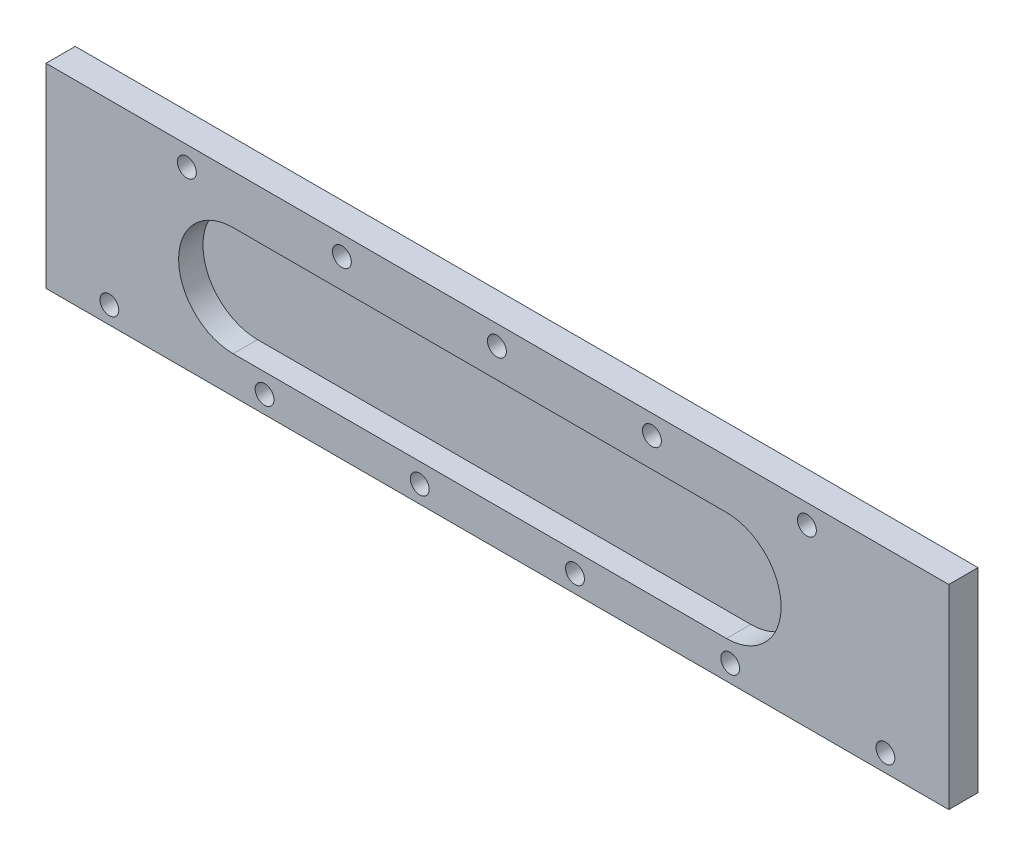
ISO-10303-21;
HEADER;
FILE_DESCRIPTION(('STEP AP214'),'2;1');
FILE_NAME('part.step','',(''),(''),'','','');
FILE_SCHEMA(('AUTOMOTIVE_DESIGN { 1 0 10303 214 1 1 1 1 }'));
ENDSEC;
DATA;
#1=APPLICATION_CONTEXT('core data for automotive mechanical design processes');
#2=APPLICATION_PROTOCOL_DEFINITION('international standard','automotive_design',2000,#1);
#3=PRODUCT_CONTEXT('',#1,'mechanical');
#4=PRODUCT('Part','Part','',(#3));
#5=PRODUCT_RELATED_PRODUCT_CATEGORY('part','',(#4));
#6=PRODUCT_DEFINITION_FORMATION('','',#4);
#7=PRODUCT_DEFINITION_CONTEXT('part definition',#1,'design');
#8=PRODUCT_DEFINITION('design','',#6,#7);
#9=PRODUCT_DEFINITION_SHAPE('','',#8);
#10=(LENGTH_UNIT() NAMED_UNIT(*) SI_UNIT(.MILLI.,.METRE.));
#11=(NAMED_UNIT(*) PLANE_ANGLE_UNIT() SI_UNIT($,.RADIAN.));
#12=(NAMED_UNIT(*) SI_UNIT($,.STERADIAN.) SOLID_ANGLE_UNIT());
#13=UNCERTAINTY_MEASURE_WITH_UNIT(LENGTH_MEASURE(1.E-05),#10,'distance_accuracy_value','');
#14=(GEOMETRIC_REPRESENTATION_CONTEXT(3) GLOBAL_UNCERTAINTY_ASSIGNED_CONTEXT((#13)) GLOBAL_UNIT_ASSIGNED_CONTEXT((#10,
#11,#12)) REPRESENTATION_CONTEXT('',''));
#15=CARTESIAN_POINT('',(0.,0.,0.));
#16=DIRECTION('',(0.,0.,1.));
#17=DIRECTION('',(1.,0.,0.));
#18=AXIS2_PLACEMENT_3D('',#15,#16,#17);
#19=CARTESIAN_POINT('',(0.,0.,7.62));
#20=DIRECTION('',(-1.,0.,0.));
#21=DIRECTION('',(0.,0.,1.));
#22=AXIS2_PLACEMENT_3D('',#19,#20,#21);
#23=PLANE('',#22);
#24=DIRECTION('',(0.,1.,0.));
#25=VECTOR('',#24,1.);
#26=CARTESIAN_POINT('',(0.,0.,0.));
#27=LINE('',#26,#25);
#28=CARTESIAN_POINT('',(0.,0.,0.));
#29=VERTEX_POINT('',#28);
#30=CARTESIAN_POINT('',(0.,50.8,0.));
#31=VERTEX_POINT('',#30);
#32=EDGE_CURVE('E156',#29,#31,#27,.T.);
#33=ORIENTED_EDGE('',*,*,#32,.T.);
#34=DIRECTION('',(0.,0.,-1.));
#35=VECTOR('',#34,1.);
#36=CARTESIAN_POINT('',(0.,50.8,7.62));
#37=LINE('',#36,#35);
#38=CARTESIAN_POINT('',(0.,50.8,7.62));
#39=VERTEX_POINT('',#38);
#40=EDGE_CURVE('E13',#39,#31,#37,.T.);
#41=ORIENTED_EDGE('',*,*,#40,.F.);
#42=DIRECTION('',(0.,1.,0.));
#43=VECTOR('',#42,1.);
#44=CARTESIAN_POINT('',(0.,0.,7.62));
#45=LINE('',#44,#43);
#46=CARTESIAN_POINT('',(0.,0.,7.62));
#47=VERTEX_POINT('',#46);
#48=EDGE_CURVE('E160',#47,#39,#45,.T.);
#49=ORIENTED_EDGE('',*,*,#48,.F.);
#50=DIRECTION('',(0.,0.,-1.));
#51=VECTOR('',#50,1.);
#52=CARTESIAN_POINT('',(0.,0.,7.62));
#53=LINE('',#52,#51);
#54=EDGE_CURVE('E166',#47,#29,#53,.T.);
#55=ORIENTED_EDGE('',*,*,#54,.T.);
#56=EDGE_LOOP('',(#33,#41,#49,#55));
#57=FACE_BOUND('',#56,.T.);
#58=ADVANCED_FACE('F45',(#57),#23,.F.);
#59=CARTESIAN_POINT('',(0.,50.8,7.62));
#60=DIRECTION('',(0.,-1.,0.));
#61=DIRECTION('',(1.,0.,0.));
#62=AXIS2_PLACEMENT_3D('',#59,#60,#61);
#63=PLANE('',#62);
#64=DIRECTION('',(-1.,0.,0.));
#65=VECTOR('',#64,1.);
#66=CARTESIAN_POINT('',(0.,50.8,0.));
#67=LINE('',#66,#65);
#68=CARTESIAN_POINT('',(-235.204,50.8,0.));
#69=VERTEX_POINT('',#68);
#70=EDGE_CURVE('E169',#31,#69,#67,.T.);
#71=ORIENTED_EDGE('',*,*,#70,.T.);
#72=DIRECTION('',(0.,0.,-1.));
#73=VECTOR('',#72,1.);
#74=CARTESIAN_POINT('',(-235.204,50.8,7.62));
#75=LINE('',#74,#73);
#76=CARTESIAN_POINT('',(-235.204,50.8,7.62));
#77=VERTEX_POINT('',#76);
#78=EDGE_CURVE('E52',#77,#69,#75,.T.);
#79=ORIENTED_EDGE('',*,*,#78,.F.);
#80=DIRECTION('',(-1.,0.,0.));
#81=VECTOR('',#80,1.);
#82=CARTESIAN_POINT('',(0.,50.8,7.62));
#83=LINE('',#82,#81);
#84=EDGE_CURVE('E96',#39,#77,#83,.T.);
#85=ORIENTED_EDGE('',*,*,#84,.F.);
#86=ORIENTED_EDGE('',*,*,#40,.T.);
#87=EDGE_LOOP('',(#71,#79,#85,#86));
#88=FACE_BOUND('',#87,.T.);
#89=ADVANCED_FACE('F198',(#88),#63,.F.);
#90=CARTESIAN_POINT('',(-235.204,0.,7.62));
#91=DIRECTION('',(1.,0.,0.));
#92=DIRECTION('',(0.,0.,-1.));
#93=AXIS2_PLACEMENT_3D('',#90,#91,#92);
#94=PLANE('',#93);
#95=DIRECTION('',(0.,-1.,0.));
#96=VECTOR('',#95,1.);
#97=CARTESIAN_POINT('',(-235.204,0.,0.));
#98=LINE('',#97,#96);
#99=CARTESIAN_POINT('',(-235.204,0.,0.));
#100=VERTEX_POINT('',#99);
#101=EDGE_CURVE('E171',#69,#100,#98,.T.);
#102=ORIENTED_EDGE('',*,*,#101,.T.);
#103=DIRECTION('',(0.,0.,-1.));
#104=VECTOR('',#103,1.);
#105=CARTESIAN_POINT('',(-235.204,0.,7.62));
#106=LINE('',#105,#104);
#107=CARTESIAN_POINT('',(-235.204,0.,7.62));
#108=VERTEX_POINT('',#107);
#109=EDGE_CURVE('E175',#108,#100,#106,.T.);
#110=ORIENTED_EDGE('',*,*,#109,.F.);
#111=DIRECTION('',(0.,-1.,0.));
#112=VECTOR('',#111,1.);
#113=CARTESIAN_POINT('',(-235.204,0.,7.62));
#114=LINE('',#113,#112);
#115=EDGE_CURVE('E163',#77,#108,#114,.T.);
#116=ORIENTED_EDGE('',*,*,#115,.F.);
#117=ORIENTED_EDGE('',*,*,#78,.T.);
#118=EDGE_LOOP('',(#102,#110,#116,#117));
#119=FACE_BOUND('',#118,.T.);
#120=ADVANCED_FACE('F180',(#119),#94,.F.);
#121=CARTESIAN_POINT('',(0.,0.,7.62));
#122=DIRECTION('',(0.,1.,0.));
#123=DIRECTION('',(-1.,0.,0.));
#124=AXIS2_PLACEMENT_3D('',#121,#122,#123);
#125=PLANE('',#124);
#126=DIRECTION('',(1.,0.,0.));
#127=VECTOR('',#126,1.);
#128=CARTESIAN_POINT('',(0.,0.,0.));
#129=LINE('',#128,#127);
#130=EDGE_CURVE('E89',#100,#29,#129,.T.);
#131=ORIENTED_EDGE('',*,*,#130,.T.);
#132=ORIENTED_EDGE('',*,*,#54,.F.);
#133=DIRECTION('',(1.,0.,0.));
#134=VECTOR('',#133,1.);
#135=CARTESIAN_POINT('',(0.,0.,7.62));
#136=LINE('',#135,#134);
#137=EDGE_CURVE('E68',#108,#47,#136,.T.);
#138=ORIENTED_EDGE('',*,*,#137,.F.);
#139=ORIENTED_EDGE('',*,*,#109,.T.);
#140=EDGE_LOOP('',(#131,#132,#138,#139));
#141=FACE_BOUND('',#140,.T.);
#142=ADVANCED_FACE('F188',(#141),#125,.F.);
#143=CARTESIAN_POINT('',(0.,0.,7.62));
#144=DIRECTION('',(0.,0.,1.));
#145=DIRECTION('',(1.,0.,0.));
#146=AXIS2_PLACEMENT_3D('',#143,#144,#145);
#147=PLANE('',#146);
#148=CARTESIAN_POINT('',(-198.501,45.72,7.62));
#149=DIRECTION('',(0.,0.,1.));
#150=DIRECTION('',(1.,0.,0.));
#151=AXIS2_PLACEMENT_3D('',#148,#149,#150);
#152=CIRCLE('',#151,2.45745);
#153=CARTESIAN_POINT('',(-196.04355,45.72,7.62));
#154=VERTEX_POINT('',#153);
#155=EDGE_CURVE('E393',#154,#154,#152,.T.);
#156=ORIENTED_EDGE('',*,*,#155,.F.);
#157=EDGE_LOOP('',(#156));
#158=FACE_BOUND('',#157,.T.);
#159=CARTESIAN_POINT('',(-158.115,45.72,7.62));
#160=DIRECTION('',(0.,0.,1.));
#161=DIRECTION('',(1.,0.,0.));
#162=AXIS2_PLACEMENT_3D('',#159,#160,#161);
#163=CIRCLE('',#162,2.45745);
#164=CARTESIAN_POINT('',(-155.65755,45.72,7.62));
#165=VERTEX_POINT('',#164);
#166=EDGE_CURVE('E395',#165,#165,#163,.T.);
#167=ORIENTED_EDGE('',*,*,#166,.F.);
#168=EDGE_LOOP('',(#167));
#169=FACE_BOUND('',#168,.T.);
#170=CARTESIAN_POINT('',(-117.729,45.72,7.62));
#171=DIRECTION('',(0.,0.,1.));
#172=DIRECTION('',(1.,0.,0.));
#173=AXIS2_PLACEMENT_3D('',#170,#171,#172);
#174=CIRCLE('',#173,2.45745);
#175=CARTESIAN_POINT('',(-115.27155,45.72,7.62));
#176=VERTEX_POINT('',#175);
#177=EDGE_CURVE('E403',#176,#176,#174,.T.);
#178=ORIENTED_EDGE('',*,*,#177,.F.);
#179=EDGE_LOOP('',(#178));
#180=FACE_BOUND('',#179,.T.);
#181=CARTESIAN_POINT('',(-77.343,45.72,7.62));
#182=DIRECTION('',(0.,0.,1.));
#183=DIRECTION('',(1.,0.,0.));
#184=AXIS2_PLACEMENT_3D('',#181,#182,#183);
#185=CIRCLE('',#184,2.45745);
#186=CARTESIAN_POINT('',(-74.88555,45.72,7.62));
#187=VERTEX_POINT('',#186);
#188=EDGE_CURVE('E409',#187,#187,#185,.T.);
#189=ORIENTED_EDGE('',*,*,#188,.F.);
#190=EDGE_LOOP('',(#189));
#191=FACE_BOUND('',#190,.T.);
#192=CARTESIAN_POINT('',(-36.957,45.72,7.62));
#193=DIRECTION('',(0.,0.,1.));
#194=DIRECTION('',(1.,0.,0.));
#195=AXIS2_PLACEMENT_3D('',#192,#193,#194);
#196=CIRCLE('',#195,2.45745);
#197=CARTESIAN_POINT('',(-34.49955,45.72,7.62));
#198=VERTEX_POINT('',#197);
#199=EDGE_CURVE('E415',#198,#198,#196,.T.);
#200=ORIENTED_EDGE('',*,*,#199,.F.);
#201=EDGE_LOOP('',(#200));
#202=FACE_BOUND('',#201,.T.);
#203=CARTESIAN_POINT('',(-218.694,4.54847930763691,7.62));
#204=DIRECTION('',(0.,0.,1.));
#205=DIRECTION('',(1.,0.,0.));
#206=AXIS2_PLACEMENT_3D('',#203,#204,#205);
#207=CIRCLE('',#206,2.45745);
#208=CARTESIAN_POINT('',(-216.23655,4.54847930763691,7.62));
#209=VERTEX_POINT('',#208);
#210=EDGE_CURVE('E421',#209,#209,#207,.T.);
#211=ORIENTED_EDGE('',*,*,#210,.F.);
#212=EDGE_LOOP('',(#211));
#213=FACE_BOUND('',#212,.T.);
#214=CARTESIAN_POINT('',(-178.2572,4.54847930763691,7.62));
#215=DIRECTION('',(0.,0.,1.));
#216=DIRECTION('',(1.,0.,0.));
#217=AXIS2_PLACEMENT_3D('',#214,#215,#216);
#218=CIRCLE('',#217,2.45745);
#219=CARTESIAN_POINT('',(-175.79975,4.54847930763691,7.62));
#220=VERTEX_POINT('',#219);
#221=EDGE_CURVE('E427',#220,#220,#218,.T.);
#222=ORIENTED_EDGE('',*,*,#221,.F.);
#223=EDGE_LOOP('',(#222));
#224=FACE_BOUND('',#223,.T.);
#225=CARTESIAN_POINT('',(-137.8204,4.54847930763691,7.62));
#226=DIRECTION('',(0.,0.,1.));
#227=DIRECTION('',(1.,0.,0.));
#228=AXIS2_PLACEMENT_3D('',#225,#226,#227);
#229=CIRCLE('',#228,2.45745);
#230=CARTESIAN_POINT('',(-135.36295,4.54847930763691,7.62));
#231=VERTEX_POINT('',#230);
#232=EDGE_CURVE('E433',#231,#231,#229,.T.);
#233=ORIENTED_EDGE('',*,*,#232,.F.);
#234=EDGE_LOOP('',(#233));
#235=FACE_BOUND('',#234,.T.);
#236=CARTESIAN_POINT('',(-97.3836,4.54847930763691,7.62));
#237=DIRECTION('',(0.,0.,1.));
#238=DIRECTION('',(1.,0.,0.));
#239=AXIS2_PLACEMENT_3D('',#236,#237,#238);
#240=CIRCLE('',#239,2.45745);
#241=CARTESIAN_POINT('',(-94.92615,4.54847930763691,7.62));
#242=VERTEX_POINT('',#241);
#243=EDGE_CURVE('E439',#242,#242,#240,.T.);
#244=ORIENTED_EDGE('',*,*,#243,.F.);
#245=EDGE_LOOP('',(#244));
#246=FACE_BOUND('',#245,.T.);
#247=CARTESIAN_POINT('',(-56.9468,4.54847930763691,7.62));
#248=DIRECTION('',(0.,0.,1.));
#249=DIRECTION('',(1.,0.,0.));
#250=AXIS2_PLACEMENT_3D('',#247,#248,#249);
#251=CIRCLE('',#250,2.45745);
#252=CARTESIAN_POINT('',(-54.48935,4.54847930763691,7.62));
#253=VERTEX_POINT('',#252);
#254=EDGE_CURVE('E445',#253,#253,#251,.T.);
#255=ORIENTED_EDGE('',*,*,#254,.F.);
#256=EDGE_LOOP('',(#255));
#257=FACE_BOUND('',#256,.T.);
#258=CARTESIAN_POINT('',(-16.51,4.54847930763691,7.62));
#259=DIRECTION('',(0.,0.,1.));
#260=DIRECTION('',(1.,0.,0.));
#261=AXIS2_PLACEMENT_3D('',#258,#259,#260);
#262=CIRCLE('',#261,2.45745);
#263=CARTESIAN_POINT('',(-14.05255,4.54847930763691,7.62));
#264=VERTEX_POINT('',#263);
#265=EDGE_CURVE('E450',#264,#264,#262,.T.);
#266=ORIENTED_EDGE('',*,*,#265,.F.);
#267=EDGE_LOOP('',(#266));
#268=FACE_BOUND('',#267,.T.);
#269=CARTESIAN_POINT('',(-57.912,23.876,7.62));
#270=DIRECTION('',(0.,0.,1.));
#271=DIRECTION('',(1.,0.,0.));
#272=AXIS2_PLACEMENT_3D('',#269,#270,#271);
#273=CIRCLE('',#272,14.224);
#274=CARTESIAN_POINT('',(-57.912,9.652,7.62));
#275=VERTEX_POINT('',#274);
#276=CARTESIAN_POINT('',(-57.912,38.1,7.62));
#277=VERTEX_POINT('',#276);
#278=EDGE_CURVE('E59',#275,#277,#273,.T.);
#279=ORIENTED_EDGE('',*,*,#278,.F.);
#280=DIRECTION('',(1.,0.,0.));
#281=VECTOR('',#280,1.);
#282=CARTESIAN_POINT('',(-57.912,9.652,7.62));
#283=LINE('',#282,#281);
#284=CARTESIAN_POINT('',(-186.436,9.652,7.62));
#285=VERTEX_POINT('',#284);
#286=EDGE_CURVE('E138',#285,#275,#283,.T.);
#287=ORIENTED_EDGE('',*,*,#286,.F.);
#288=CARTESIAN_POINT('',(-186.436,23.876,7.62));
#289=DIRECTION('',(0.,0.,1.));
#290=DIRECTION('',(1.,0.,0.));
#291=AXIS2_PLACEMENT_3D('',#288,#289,#290);
#292=CIRCLE('',#291,14.224);
#293=CARTESIAN_POINT('',(-186.436,38.1,7.62));
#294=VERTEX_POINT('',#293);
#295=EDGE_CURVE('E141',#294,#285,#292,.T.);
#296=ORIENTED_EDGE('',*,*,#295,.F.);
#297=DIRECTION('',(-1.,0.,0.));
#298=VECTOR('',#297,1.);
#299=CARTESIAN_POINT('',(-57.912,38.1,7.62));
#300=LINE('',#299,#298);
#301=EDGE_CURVE('E150',#277,#294,#300,.T.);
#302=ORIENTED_EDGE('',*,*,#301,.F.);
#303=EDGE_LOOP('',(#279,#287,#296,#302));
#304=FACE_BOUND('',#303,.T.);
#305=ORIENTED_EDGE('',*,*,#48,.T.);
#306=ORIENTED_EDGE('',*,*,#84,.T.);
#307=ORIENTED_EDGE('',*,*,#115,.T.);
#308=ORIENTED_EDGE('',*,*,#137,.T.);
#309=EDGE_LOOP('',(#305,#306,#307,#308));
#310=FACE_BOUND('',#309,.T.);
#311=ADVANCED_FACE('F190',(#158,#169,#180,#191,#202,#213,#224,#235,#246,#257,#268,#304,#310),
#147,.T.);
#312=CARTESIAN_POINT('',(0.,0.,0.));
#313=DIRECTION('',(0.,0.,1.));
#314=DIRECTION('',(1.,0.,0.));
#315=AXIS2_PLACEMENT_3D('',#312,#313,#314);
#316=PLANE('',#315);
#317=CARTESIAN_POINT('',(-198.501,45.72,0.));
#318=DIRECTION('',(0.,0.,1.));
#319=DIRECTION('',(1.,0.,0.));
#320=AXIS2_PLACEMENT_3D('',#317,#318,#319);
#321=CIRCLE('',#320,2.45745);
#322=CARTESIAN_POINT('',(-196.04355,45.72,0.));
#323=VERTEX_POINT('',#322);
#324=EDGE_CURVE('E390',#323,#323,#321,.T.);
#325=ORIENTED_EDGE('',*,*,#324,.T.);
#326=EDGE_LOOP('',(#325));
#327=FACE_BOUND('',#326,.T.);
#328=CARTESIAN_POINT('',(-158.115,45.72,0.));
#329=DIRECTION('',(0.,0.,1.));
#330=DIRECTION('',(1.,0.,0.));
#331=AXIS2_PLACEMENT_3D('',#328,#329,#330);
#332=CIRCLE('',#331,2.45745);
#333=CARTESIAN_POINT('',(-155.65755,45.72,0.));
#334=VERTEX_POINT('',#333);
#335=EDGE_CURVE('E400',#334,#334,#332,.T.);
#336=ORIENTED_EDGE('',*,*,#335,.T.);
#337=EDGE_LOOP('',(#336));
#338=FACE_BOUND('',#337,.T.);
#339=CARTESIAN_POINT('',(-117.729,45.72,0.));
#340=DIRECTION('',(0.,0.,1.));
#341=DIRECTION('',(1.,0.,0.));
#342=AXIS2_PLACEMENT_3D('',#339,#340,#341);
#343=CIRCLE('',#342,2.45745);
#344=CARTESIAN_POINT('',(-115.27155,45.72,0.));
#345=VERTEX_POINT('',#344);
#346=EDGE_CURVE('E406',#345,#345,#343,.T.);
#347=ORIENTED_EDGE('',*,*,#346,.T.);
#348=EDGE_LOOP('',(#347));
#349=FACE_BOUND('',#348,.T.);
#350=CARTESIAN_POINT('',(-77.343,45.72,0.));
#351=DIRECTION('',(0.,0.,1.));
#352=DIRECTION('',(1.,0.,0.));
#353=AXIS2_PLACEMENT_3D('',#350,#351,#352);
#354=CIRCLE('',#353,2.45745);
#355=CARTESIAN_POINT('',(-74.88555,45.72,0.));
#356=VERTEX_POINT('',#355);
#357=EDGE_CURVE('E412',#356,#356,#354,.T.);
#358=ORIENTED_EDGE('',*,*,#357,.T.);
#359=EDGE_LOOP('',(#358));
#360=FACE_BOUND('',#359,.T.);
#361=CARTESIAN_POINT('',(-36.957,45.72,0.));
#362=DIRECTION('',(0.,0.,1.));
#363=DIRECTION('',(1.,0.,0.));
#364=AXIS2_PLACEMENT_3D('',#361,#362,#363);
#365=CIRCLE('',#364,2.45745);
#366=CARTESIAN_POINT('',(-34.49955,45.72,0.));
#367=VERTEX_POINT('',#366);
#368=EDGE_CURVE('E418',#367,#367,#365,.T.);
#369=ORIENTED_EDGE('',*,*,#368,.T.);
#370=EDGE_LOOP('',(#369));
#371=FACE_BOUND('',#370,.T.);
#372=CARTESIAN_POINT('',(-218.694,4.54847930763691,0.));
#373=DIRECTION('',(0.,0.,1.));
#374=DIRECTION('',(1.,0.,0.));
#375=AXIS2_PLACEMENT_3D('',#372,#373,#374);
#376=CIRCLE('',#375,2.45745);
#377=CARTESIAN_POINT('',(-216.23655,4.54847930763691,0.));
#378=VERTEX_POINT('',#377);
#379=EDGE_CURVE('E424',#378,#378,#376,.T.);
#380=ORIENTED_EDGE('',*,*,#379,.T.);
#381=EDGE_LOOP('',(#380));
#382=FACE_BOUND('',#381,.T.);
#383=CARTESIAN_POINT('',(-178.2572,4.54847930763691,0.));
#384=DIRECTION('',(0.,0.,1.));
#385=DIRECTION('',(1.,0.,0.));
#386=AXIS2_PLACEMENT_3D('',#383,#384,#385);
#387=CIRCLE('',#386,2.45745);
#388=CARTESIAN_POINT('',(-175.79975,4.54847930763691,0.));
#389=VERTEX_POINT('',#388);
#390=EDGE_CURVE('E430',#389,#389,#387,.T.);
#391=ORIENTED_EDGE('',*,*,#390,.T.);
#392=EDGE_LOOP('',(#391));
#393=FACE_BOUND('',#392,.T.);
#394=CARTESIAN_POINT('',(-137.8204,4.54847930763691,0.));
#395=DIRECTION('',(0.,0.,1.));
#396=DIRECTION('',(1.,0.,0.));
#397=AXIS2_PLACEMENT_3D('',#394,#395,#396);
#398=CIRCLE('',#397,2.45745);
#399=CARTESIAN_POINT('',(-135.36295,4.54847930763691,0.));
#400=VERTEX_POINT('',#399);
#401=EDGE_CURVE('E436',#400,#400,#398,.T.);
#402=ORIENTED_EDGE('',*,*,#401,.T.);
#403=EDGE_LOOP('',(#402));
#404=FACE_BOUND('',#403,.T.);
#405=CARTESIAN_POINT('',(-97.3836,4.54847930763691,0.));
#406=DIRECTION('',(0.,0.,1.));
#407=DIRECTION('',(1.,0.,0.));
#408=AXIS2_PLACEMENT_3D('',#405,#406,#407);
#409=CIRCLE('',#408,2.45745);
#410=CARTESIAN_POINT('',(-94.92615,4.54847930763691,0.));
#411=VERTEX_POINT('',#410);
#412=EDGE_CURVE('E442',#411,#411,#409,.T.);
#413=ORIENTED_EDGE('',*,*,#412,.T.);
#414=EDGE_LOOP('',(#413));
#415=FACE_BOUND('',#414,.T.);
#416=CARTESIAN_POINT('',(-56.9468,4.54847930763691,0.));
#417=DIRECTION('',(0.,0.,1.));
#418=DIRECTION('',(1.,0.,0.));
#419=AXIS2_PLACEMENT_3D('',#416,#417,#418);
#420=CIRCLE('',#419,2.45745);
#421=CARTESIAN_POINT('',(-54.48935,4.54847930763691,0.));
#422=VERTEX_POINT('',#421);
#423=EDGE_CURVE('E448',#422,#422,#420,.T.);
#424=ORIENTED_EDGE('',*,*,#423,.T.);
#425=EDGE_LOOP('',(#424));
#426=FACE_BOUND('',#425,.T.);
#427=CARTESIAN_POINT('',(-16.51,4.54847930763691,0.));
#428=DIRECTION('',(0.,0.,1.));
#429=DIRECTION('',(1.,0.,0.));
#430=AXIS2_PLACEMENT_3D('',#427,#428,#429);
#431=CIRCLE('',#430,2.45745);
#432=CARTESIAN_POINT('',(-14.05255,4.54847930763691,0.));
#433=VERTEX_POINT('',#432);
#434=EDGE_CURVE('E144',#433,#433,#431,.T.);
#435=ORIENTED_EDGE('',*,*,#434,.T.);
#436=EDGE_LOOP('',(#435));
#437=FACE_BOUND('',#436,.T.);
#438=ORIENTED_EDGE('',*,*,#32,.F.);
#439=ORIENTED_EDGE('',*,*,#130,.F.);
#440=ORIENTED_EDGE('',*,*,#101,.F.);
#441=ORIENTED_EDGE('',*,*,#70,.F.);
#442=EDGE_LOOP('',(#438,#439,#440,#441));
#443=FACE_BOUND('',#442,.T.);
#444=ADVANCED_FACE('F184',(#327,#338,#349,#360,#371,#382,#393,#404,#415,#426,#437,#443),#316,.F.);
#445=CARTESIAN_POINT('',(-57.912,23.876,1.27));
#446=DIRECTION('',(0.,0.,1.));
#447=DIRECTION('',(1.,0.,0.));
#448=AXIS2_PLACEMENT_3D('',#445,#446,#447);
#449=CYLINDRICAL_SURFACE('',#448,14.224);
#450=ORIENTED_EDGE('',*,*,#278,.T.);
#451=DIRECTION('',(0.,0.,1.));
#452=VECTOR('',#451,1.);
#453=CARTESIAN_POINT('',(-57.912,38.1,1.27));
#454=LINE('',#453,#452);
#455=CARTESIAN_POINT('',(-57.912,38.1,1.27));
#456=VERTEX_POINT('',#455);
#457=EDGE_CURVE('E116',#456,#277,#454,.T.);
#458=ORIENTED_EDGE('',*,*,#457,.F.);
#459=CARTESIAN_POINT('',(-57.912,23.876,1.27));
#460=DIRECTION('',(0.,0.,1.));
#461=DIRECTION('',(1.,0.,0.));
#462=AXIS2_PLACEMENT_3D('',#459,#460,#461);
#463=CIRCLE('',#462,14.224);
#464=CARTESIAN_POINT('',(-57.912,9.652,1.27));
#465=VERTEX_POINT('',#464);
#466=EDGE_CURVE('E120',#465,#456,#463,.T.);
#467=ORIENTED_EDGE('',*,*,#466,.F.);
#468=DIRECTION('',(0.,0.,1.));
#469=VECTOR('',#468,1.);
#470=CARTESIAN_POINT('',(-57.912,9.652,1.27));
#471=LINE('',#470,#469);
#472=EDGE_CURVE('E154',#465,#275,#471,.T.);
#473=ORIENTED_EDGE('',*,*,#472,.T.);
#474=EDGE_LOOP('',(#450,#458,#467,#473));
#475=FACE_BOUND('',#474,.T.);
#476=ADVANCED_FACE('F118',(#475),#449,.F.);
#477=CARTESIAN_POINT('',(-57.912,9.652,1.27));
#478=DIRECTION('',(0.,-1.,0.));
#479=DIRECTION('',(0.,0.,-1.));
#480=AXIS2_PLACEMENT_3D('',#477,#478,#479);
#481=PLANE('',#480);
#482=ORIENTED_EDGE('',*,*,#286,.T.);
#483=ORIENTED_EDGE('',*,*,#472,.F.);
#484=DIRECTION('',(1.,0.,0.));
#485=VECTOR('',#484,1.);
#486=CARTESIAN_POINT('',(-57.912,9.652,1.27));
#487=LINE('',#486,#485);
#488=CARTESIAN_POINT('',(-186.436,9.652,1.27));
#489=VERTEX_POINT('',#488);
#490=EDGE_CURVE('E126',#489,#465,#487,.T.);
#491=ORIENTED_EDGE('',*,*,#490,.F.);
#492=DIRECTION('',(0.,0.,1.));
#493=VECTOR('',#492,1.);
#494=CARTESIAN_POINT('',(-186.436,9.652,1.27));
#495=LINE('',#494,#493);
#496=EDGE_CURVE('E157',#489,#285,#495,.T.);
#497=ORIENTED_EDGE('',*,*,#496,.T.);
#498=EDGE_LOOP('',(#482,#483,#491,#497));
#499=FACE_BOUND('',#498,.T.);
#500=ADVANCED_FACE('F225',(#499),#481,.F.);
#501=CARTESIAN_POINT('',(-186.436,23.876,1.27));
#502=DIRECTION('',(0.,0.,1.));
#503=DIRECTION('',(1.,0.,0.));
#504=AXIS2_PLACEMENT_3D('',#501,#502,#503);
#505=CYLINDRICAL_SURFACE('',#504,14.224);
#506=ORIENTED_EDGE('',*,*,#295,.T.);
#507=ORIENTED_EDGE('',*,*,#496,.F.);
#508=CARTESIAN_POINT('',(-186.436,23.876,1.27));
#509=DIRECTION('',(0.,0.,1.));
#510=DIRECTION('',(1.,0.,0.));
#511=AXIS2_PLACEMENT_3D('',#508,#509,#510);
#512=CIRCLE('',#511,14.224);
#513=CARTESIAN_POINT('',(-186.436,38.1,1.27));
#514=VERTEX_POINT('',#513);
#515=EDGE_CURVE('E134',#514,#489,#512,.T.);
#516=ORIENTED_EDGE('',*,*,#515,.F.);
#517=DIRECTION('',(0.,0.,1.));
#518=VECTOR('',#517,1.);
#519=CARTESIAN_POINT('',(-186.436,38.1,1.27));
#520=LINE('',#519,#518);
#521=EDGE_CURVE('E125',#514,#294,#520,.T.);
#522=ORIENTED_EDGE('',*,*,#521,.T.);
#523=EDGE_LOOP('',(#506,#507,#516,#522));
#524=FACE_BOUND('',#523,.T.);
#525=ADVANCED_FACE('F236',(#524),#505,.F.);
#526=CARTESIAN_POINT('',(-57.912,38.1,1.27));
#527=DIRECTION('',(0.,1.,0.));
#528=DIRECTION('',(0.,0.,1.));
#529=AXIS2_PLACEMENT_3D('',#526,#527,#528);
#530=PLANE('',#529);
#531=ORIENTED_EDGE('',*,*,#301,.T.);
#532=ORIENTED_EDGE('',*,*,#521,.F.);
#533=DIRECTION('',(-1.,0.,0.));
#534=VECTOR('',#533,1.);
#535=CARTESIAN_POINT('',(-57.912,38.1,1.27));
#536=LINE('',#535,#534);
#537=EDGE_CURVE('E129',#456,#514,#536,.T.);
#538=ORIENTED_EDGE('',*,*,#537,.F.);
#539=ORIENTED_EDGE('',*,*,#457,.T.);
#540=EDGE_LOOP('',(#531,#532,#538,#539));
#541=FACE_BOUND('',#540,.T.);
#542=ADVANCED_FACE('F130',(#541),#530,.F.);
#543=CARTESIAN_POINT('',(-57.912,23.876,1.27));
#544=DIRECTION('',(0.,0.,1.));
#545=DIRECTION('',(1.,0.,0.));
#546=AXIS2_PLACEMENT_3D('',#543,#544,#545);
#547=PLANE('',#546);
#548=ORIENTED_EDGE('',*,*,#466,.T.);
#549=ORIENTED_EDGE('',*,*,#537,.T.);
#550=ORIENTED_EDGE('',*,*,#515,.T.);
#551=ORIENTED_EDGE('',*,*,#490,.T.);
#552=EDGE_LOOP('',(#548,#549,#550,#551));
#553=FACE_BOUND('',#552,.T.);
#554=ADVANCED_FACE('F136',(#553),#547,.T.);
#555=CARTESIAN_POINT('',(-16.51,4.54847930763691,7.62));
#556=DIRECTION('',(0.,0.,1.));
#557=DIRECTION('',(1.,0.,0.));
#558=AXIS2_PLACEMENT_3D('',#555,#556,#557);
#559=CYLINDRICAL_SURFACE('',#558,2.45745);
#560=ORIENTED_EDGE('',*,*,#434,.F.);
#561=EDGE_LOOP('',(#560));
#562=FACE_BOUND('',#561,.T.);
#563=ORIENTED_EDGE('',*,*,#265,.T.);
#564=EDGE_LOOP('',(#563));
#565=FACE_BOUND('',#564,.T.);
#566=ADVANCED_FACE('F263',(#562,#565),#559,.F.);
#567=CARTESIAN_POINT('',(-56.9468,4.54847930763691,7.62));
#568=DIRECTION('',(0.,0.,1.));
#569=DIRECTION('',(1.,0.,0.));
#570=AXIS2_PLACEMENT_3D('',#567,#568,#569);
#571=CYLINDRICAL_SURFACE('',#570,2.45745);
#572=ORIENTED_EDGE('',*,*,#423,.F.);
#573=EDGE_LOOP('',(#572));
#574=FACE_BOUND('',#573,.T.);
#575=ORIENTED_EDGE('',*,*,#254,.T.);
#576=EDGE_LOOP('',(#575));
#577=FACE_BOUND('',#576,.T.);
#578=ADVANCED_FACE('F283',(#574,#577),#571,.F.);
#579=CARTESIAN_POINT('',(-97.3836,4.54847930763691,7.62));
#580=DIRECTION('',(0.,0.,1.));
#581=DIRECTION('',(1.,0.,0.));
#582=AXIS2_PLACEMENT_3D('',#579,#580,#581);
#583=CYLINDRICAL_SURFACE('',#582,2.45745);
#584=ORIENTED_EDGE('',*,*,#412,.F.);
#585=EDGE_LOOP('',(#584));
#586=FACE_BOUND('',#585,.T.);
#587=ORIENTED_EDGE('',*,*,#243,.T.);
#588=EDGE_LOOP('',(#587));
#589=FACE_BOUND('',#588,.T.);
#590=ADVANCED_FACE('F293',(#586,#589),#583,.F.);
#591=CARTESIAN_POINT('',(-137.8204,4.54847930763691,7.62));
#592=DIRECTION('',(0.,0.,1.));
#593=DIRECTION('',(1.,0.,0.));
#594=AXIS2_PLACEMENT_3D('',#591,#592,#593);
#595=CYLINDRICAL_SURFACE('',#594,2.45745);
#596=ORIENTED_EDGE('',*,*,#401,.F.);
#597=EDGE_LOOP('',(#596));
#598=FACE_BOUND('',#597,.T.);
#599=ORIENTED_EDGE('',*,*,#232,.T.);
#600=EDGE_LOOP('',(#599));
#601=FACE_BOUND('',#600,.T.);
#602=ADVANCED_FACE('F303',(#598,#601),#595,.F.);
#603=CARTESIAN_POINT('',(-178.2572,4.54847930763691,7.62));
#604=DIRECTION('',(0.,0.,1.));
#605=DIRECTION('',(1.,0.,0.));
#606=AXIS2_PLACEMENT_3D('',#603,#604,#605);
#607=CYLINDRICAL_SURFACE('',#606,2.45745);
#608=ORIENTED_EDGE('',*,*,#390,.F.);
#609=EDGE_LOOP('',(#608));
#610=FACE_BOUND('',#609,.T.);
#611=ORIENTED_EDGE('',*,*,#221,.T.);
#612=EDGE_LOOP('',(#611));
#613=FACE_BOUND('',#612,.T.);
#614=ADVANCED_FACE('F313',(#610,#613),#607,.F.);
#615=CARTESIAN_POINT('',(-218.694,4.54847930763691,7.62));
#616=DIRECTION('',(0.,0.,1.));
#617=DIRECTION('',(1.,0.,0.));
#618=AXIS2_PLACEMENT_3D('',#615,#616,#617);
#619=CYLINDRICAL_SURFACE('',#618,2.45745);
#620=ORIENTED_EDGE('',*,*,#379,.F.);
#621=EDGE_LOOP('',(#620));
#622=FACE_BOUND('',#621,.T.);
#623=ORIENTED_EDGE('',*,*,#210,.T.);
#624=EDGE_LOOP('',(#623));
#625=FACE_BOUND('',#624,.T.);
#626=ADVANCED_FACE('F323',(#622,#625),#619,.F.);
#627=CARTESIAN_POINT('',(-36.957,45.72,7.62));
#628=DIRECTION('',(0.,0.,1.));
#629=DIRECTION('',(1.,0.,0.));
#630=AXIS2_PLACEMENT_3D('',#627,#628,#629);
#631=CYLINDRICAL_SURFACE('',#630,2.45745);
#632=ORIENTED_EDGE('',*,*,#368,.F.);
#633=EDGE_LOOP('',(#632));
#634=FACE_BOUND('',#633,.T.);
#635=ORIENTED_EDGE('',*,*,#199,.T.);
#636=EDGE_LOOP('',(#635));
#637=FACE_BOUND('',#636,.T.);
#638=ADVANCED_FACE('F333',(#634,#637),#631,.F.);
#639=CARTESIAN_POINT('',(-77.343,45.72,7.62));
#640=DIRECTION('',(0.,0.,1.));
#641=DIRECTION('',(1.,0.,0.));
#642=AXIS2_PLACEMENT_3D('',#639,#640,#641);
#643=CYLINDRICAL_SURFACE('',#642,2.45745);
#644=ORIENTED_EDGE('',*,*,#357,.F.);
#645=EDGE_LOOP('',(#644));
#646=FACE_BOUND('',#645,.T.);
#647=ORIENTED_EDGE('',*,*,#188,.T.);
#648=EDGE_LOOP('',(#647));
#649=FACE_BOUND('',#648,.T.);
#650=ADVANCED_FACE('F343',(#646,#649),#643,.F.);
#651=CARTESIAN_POINT('',(-117.729,45.72,7.62));
#652=DIRECTION('',(0.,0.,1.));
#653=DIRECTION('',(1.,0.,0.));
#654=AXIS2_PLACEMENT_3D('',#651,#652,#653);
#655=CYLINDRICAL_SURFACE('',#654,2.45745);
#656=ORIENTED_EDGE('',*,*,#346,.F.);
#657=EDGE_LOOP('',(#656));
#658=FACE_BOUND('',#657,.T.);
#659=ORIENTED_EDGE('',*,*,#177,.T.);
#660=EDGE_LOOP('',(#659));
#661=FACE_BOUND('',#660,.T.);
#662=ADVANCED_FACE('F353',(#658,#661),#655,.F.);
#663=CARTESIAN_POINT('',(-158.115,45.72,7.62));
#664=DIRECTION('',(0.,0.,1.));
#665=DIRECTION('',(1.,0.,0.));
#666=AXIS2_PLACEMENT_3D('',#663,#664,#665);
#667=CYLINDRICAL_SURFACE('',#666,2.45745);
#668=ORIENTED_EDGE('',*,*,#335,.F.);
#669=EDGE_LOOP('',(#668));
#670=FACE_BOUND('',#669,.T.);
#671=ORIENTED_EDGE('',*,*,#166,.T.);
#672=EDGE_LOOP('',(#671));
#673=FACE_BOUND('',#672,.T.);
#674=ADVANCED_FACE('F363',(#670,#673),#667,.F.);
#675=CARTESIAN_POINT('',(-198.501,45.72,7.62));
#676=DIRECTION('',(0.,0.,1.));
#677=DIRECTION('',(1.,0.,0.));
#678=AXIS2_PLACEMENT_3D('',#675,#676,#677);
#679=CYLINDRICAL_SURFACE('',#678,2.45745);
#680=ORIENTED_EDGE('',*,*,#324,.F.);
#681=EDGE_LOOP('',(#680));
#682=FACE_BOUND('',#681,.T.);
#683=ORIENTED_EDGE('',*,*,#155,.T.);
#684=EDGE_LOOP('',(#683));
#685=FACE_BOUND('',#684,.T.);
#686=ADVANCED_FACE('F373',(#682,#685),#679,.F.);
#687=CLOSED_SHELL('',(#58,#89,#120,#142,#311,#444,#476,#500,#525,#542,#554,#566,#578,#590,#602,
#614,#626,#638,#650,#662,#674,#686));
#688=MANIFOLD_SOLID_BREP('B2',#687);
#689=ADVANCED_BREP_SHAPE_REPRESENTATION('',(#18,#688),#14);
#690=SHAPE_DEFINITION_REPRESENTATION(#9,#689);
ENDSEC;
END-ISO-10303-21;
